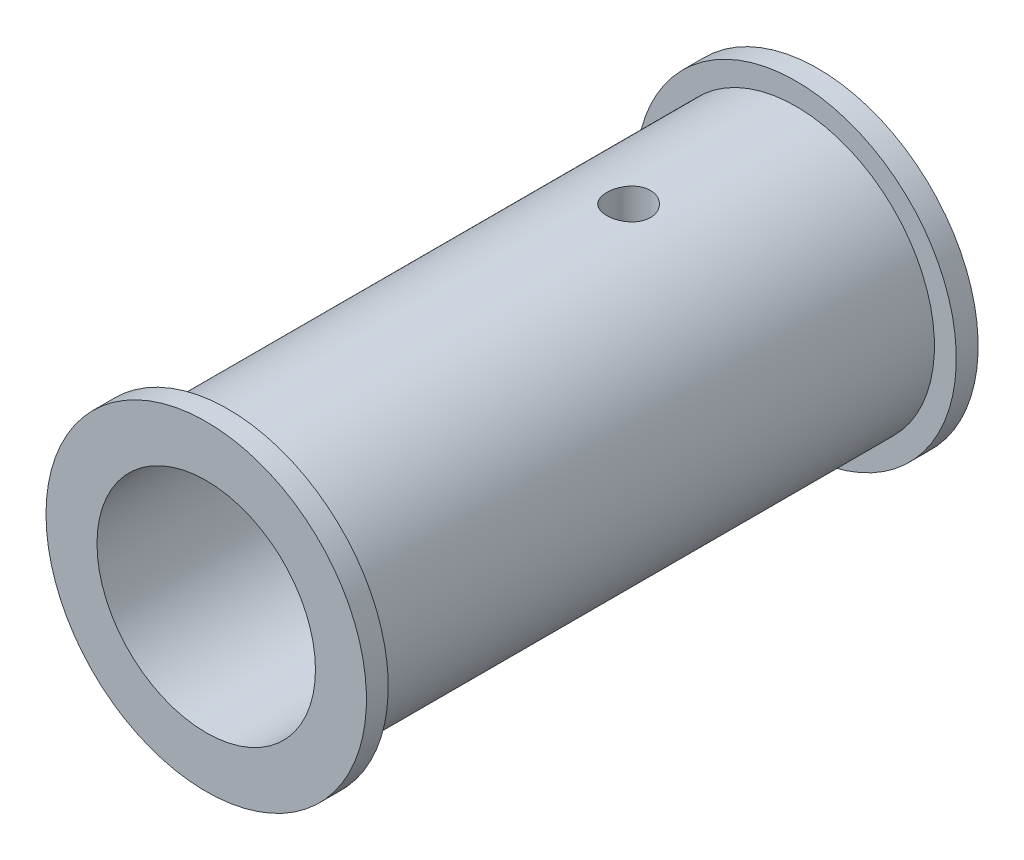
ISO-10303-21;
HEADER;
FILE_DESCRIPTION(('STEP AP214'),'2;1');
FILE_NAME('part.step','',(''),(''),'','','');
FILE_SCHEMA(('AUTOMOTIVE_DESIGN { 1 0 10303 214 1 1 1 1 }'));
ENDSEC;
DATA;
#1=APPLICATION_CONTEXT('core data for automotive mechanical design processes');
#2=APPLICATION_PROTOCOL_DEFINITION('international standard','automotive_design',2000,#1);
#3=PRODUCT_CONTEXT('',#1,'mechanical');
#4=PRODUCT('Part','Part','',(#3));
#5=PRODUCT_RELATED_PRODUCT_CATEGORY('part','',(#4));
#6=PRODUCT_DEFINITION_FORMATION('','',#4);
#7=PRODUCT_DEFINITION_CONTEXT('part definition',#1,'design');
#8=PRODUCT_DEFINITION('design','',#6,#7);
#9=PRODUCT_DEFINITION_SHAPE('','',#8);
#10=(LENGTH_UNIT() NAMED_UNIT(*) SI_UNIT(.MILLI.,.METRE.));
#11=(NAMED_UNIT(*) PLANE_ANGLE_UNIT() SI_UNIT($,.RADIAN.));
#12=(NAMED_UNIT(*) SI_UNIT($,.STERADIAN.) SOLID_ANGLE_UNIT());
#13=UNCERTAINTY_MEASURE_WITH_UNIT(LENGTH_MEASURE(1.E-05),#10,'distance_accuracy_value','');
#14=(GEOMETRIC_REPRESENTATION_CONTEXT(3) GLOBAL_UNCERTAINTY_ASSIGNED_CONTEXT((#13)) GLOBAL_UNIT_ASSIGNED_CONTEXT((#10,
#11,#12)) REPRESENTATION_CONTEXT('',''));
#15=CARTESIAN_POINT('',(0.,0.,0.));
#16=DIRECTION('',(0.,0.,1.));
#17=DIRECTION('',(1.,0.,0.));
#18=AXIS2_PLACEMENT_3D('',#15,#16,#17);
#19=CARTESIAN_POINT('',(0.,0.,0.));
#20=DIRECTION('',(0.,0.,-1.));
#21=DIRECTION('',(-1.,0.,0.));
#22=AXIS2_PLACEMENT_3D('',#19,#20,#21);
#23=CYLINDRICAL_SURFACE('',#22,9.49999999999999);
#24=CARTESIAN_POINT('',(0.,0.,-16.5));
#25=DIRECTION('',(0.,0.,-1.));
#26=DIRECTION('',(-1.,0.,0.));
#27=AXIS2_PLACEMENT_3D('',#24,#25,#26);
#28=CIRCLE('',#27,9.49999999999999);
#29=CARTESIAN_POINT('',(-9.49999999999999,0.,-16.5));
#30=VERTEX_POINT('',#29);
#31=EDGE_CURVE('E159',#30,#30,#28,.T.);
#32=ORIENTED_EDGE('',*,*,#31,.F.);
#33=EDGE_LOOP('',(#32));
#34=FACE_BOUND('',#33,.T.);
#35=CARTESIAN_POINT('',(0.,0.,22.5));
#36=DIRECTION('',(0.,0.,-1.));
#37=DIRECTION('',(-1.,0.,0.));
#38=AXIS2_PLACEMENT_3D('',#35,#36,#37);
#39=CIRCLE('',#38,9.49999999999999);
#40=CARTESIAN_POINT('',(-9.49999999999999,0.,22.5));
#41=VERTEX_POINT('',#40);
#42=EDGE_CURVE('E163',#41,#41,#39,.T.);
#43=ORIENTED_EDGE('',*,*,#42,.T.);
#44=EDGE_LOOP('',(#43));
#45=FACE_BOUND('',#44,.T.);
#46=CARTESIAN_POINT('',(0.,9.49999999999999,-6.5));
#47=CARTESIAN_POINT('',(0.0836976001065212,9.49999861203617,-6.49999659075089));
#48=CARTESIAN_POINT('',(0.167442437394015,9.4988823423191,-6.49297105489717));
#49=CARTESIAN_POINT('',(0.332587635211273,9.49453678011782,-6.46506375653031));
#50=CARTESIAN_POINT('',(0.413985694895261,9.49130548294468,-6.44416884792844));
#51=CARTESIAN_POINT('',(0.572023766729428,9.48309267200423,-6.38916582150304));
#52=CARTESIAN_POINT('',(0.648667457404599,9.47811253172854,-6.35506807066557));
#53=CARTESIAN_POINT('',(0.795134710469113,9.46695108120926,-6.27465345446147));
#54=CARTESIAN_POINT('',(0.864959141108909,9.46076992418341,-6.22833814746046));
#55=CARTESIAN_POINT('',(0.996418466512016,9.4478332438405,-6.12437811450022));
#56=CARTESIAN_POINT('',(1.05798606000114,9.44107365911175,-6.06664878123631));
#57=CARTESIAN_POINT('',(1.17060304704613,9.42777343334238,-5.94168151829407));
#58=CARTESIAN_POINT('',(1.22165180906462,9.4212328054674,-5.87444301810582));
#59=CARTESIAN_POINT('',(1.31204764005015,9.40907168619826,-5.73190915553054));
#60=CARTESIAN_POINT('',(1.35132892424659,9.40345644380091,-5.6565715852408));
#61=CARTESIAN_POINT('',(1.41665421811941,9.3938377586289,-5.50026432521204));
#62=CARTESIAN_POINT('',(1.44269902834657,9.38983421838047,-5.41929497642355));
#63=CARTESIAN_POINT('',(1.4806016253586,9.38393240557448,-5.25473305104834));
#64=CARTESIAN_POINT('',(1.49257509267669,9.382016976237,-5.17116774521641));
#65=CARTESIAN_POINT('',(1.50235362805524,9.38045626095233,-5.00319382694182));
#66=CARTESIAN_POINT('',(1.50015959652364,9.38081083073654,-4.91878526843207));
#67=CARTESIAN_POINT('',(1.48175980710843,9.38373437383501,-4.75234202844382));
#68=CARTESIAN_POINT('',(1.46568339888114,9.3862829041541,-4.67029263670841));
#69=CARTESIAN_POINT('',(1.4201779253579,9.39327524902391,-4.51007060392592));
#70=CARTESIAN_POINT('',(1.39074844516594,9.39771912246497,-4.43189808342161));
#71=CARTESIAN_POINT('',(1.3192392577636,9.40802379337807,-4.28125818725081));
#72=CARTESIAN_POINT('',(1.27710525865785,9.41389065039574,-4.20881701561895));
#73=CARTESIAN_POINT('',(1.1814216728908,9.42637594353947,-4.07198394790952));
#74=CARTESIAN_POINT('',(1.12787125747699,9.4329944342126,-4.00759263673453));
#75=CARTESIAN_POINT('',(1.01016734202821,9.44632735425787,-3.88793788340068));
#76=CARTESIAN_POINT('',(0.945902736525758,9.45304203303563,-3.83278370453035));
#77=CARTESIAN_POINT('',(0.808972007834443,9.46574266984971,-3.73402607857166));
#78=CARTESIAN_POINT('',(0.73630584030216,9.47172862403948,-3.69042269245236));
#79=CARTESIAN_POINT('',(0.584536306884603,9.48230461469924,-3.61599678624987));
#80=CARTESIAN_POINT('',(0.505428458120266,9.48689366833473,-3.58518325936849));
#81=CARTESIAN_POINT('',(0.343072096390924,9.49415073946818,-3.53730969299787));
#82=CARTESIAN_POINT('',(0.259823894418548,9.49681890101703,-3.52024862217756));
#83=CARTESIAN_POINT('',(0.0924923680310958,9.49991434597552,-3.5005108630843));
#84=CARTESIAN_POINT('',(0.00842716740136877,9.50036501369998,-3.49768406157555));
#85=CARTESIAN_POINT('',(-0.158976265712539,9.49903852875432,-3.50609582484365));
#86=CARTESIAN_POINT('',(-0.242314523112228,9.49726145274319,-3.51733390563322));
#87=CARTESIAN_POINT('',(-0.405439567370637,9.49169362069364,-3.55343158131569));
#88=CARTESIAN_POINT('',(-0.485243062795081,9.48791376028193,-3.57821749557923));
#89=CARTESIAN_POINT('',(-0.639561861197124,9.47876264558504,-3.64062916757298));
#90=CARTESIAN_POINT('',(-0.714076892756962,9.47339130969429,-3.67825558373644));
#91=CARTESIAN_POINT('',(-0.856359938682377,9.46159558199889,-3.7656284951105));
#92=CARTESIAN_POINT('',(-0.92406920731113,9.4551631094348,-3.81546954378735));
#93=CARTESIAN_POINT('',(-1.05021609132263,9.44198475905151,-3.92572600258905));
#94=CARTESIAN_POINT('',(-1.10865310573566,9.43523886095462,-3.98614209758918));
#95=CARTESIAN_POINT('',(-1.21514760920431,9.42211913600068,-4.11650426556288));
#96=CARTESIAN_POINT('',(-1.26310409838576,9.41574932753234,-4.18653331358802));
#97=CARTESIAN_POINT('',(-1.34657266649327,9.40417594303637,-4.33374131226607));
#98=CARTESIAN_POINT('',(-1.38208510941917,9.39897233289796,-4.41092005370034));
#99=CARTESIAN_POINT('',(-1.43950349612765,9.39035010587672,-4.56994411093857));
#100=CARTESIAN_POINT('',(-1.46146126125825,9.38692469878067,-4.65177033116239));
#101=CARTESIAN_POINT('',(-1.49131110199775,9.38222912838245,-4.81800766724035));
#102=CARTESIAN_POINT('',(-1.49920426388363,9.38095879863366,-4.90241858295376));
#103=CARTESIAN_POINT('',(-1.5006729373316,9.38072387634563,-5.07042167299111));
#104=CARTESIAN_POINT('',(-1.49440732883688,9.38173369742787,-5.15401246558048));
#105=CARTESIAN_POINT('',(-1.46807821019621,9.38588947240366,-5.31893513302053));
#106=CARTESIAN_POINT('',(-1.44801473210917,9.38903542133397,-5.40026701311925));
#107=CARTESIAN_POINT('',(-1.39471776903661,9.39709967714347,-5.55831106484561));
#108=CARTESIAN_POINT('',(-1.3614965806929,9.40201632881048,-5.63502747300764));
#109=CARTESIAN_POINT('',(-1.28284324745908,9.41306982252276,-5.7818235683254));
#110=CARTESIAN_POINT('',(-1.23741059974182,9.41920671481074,-5.8519029820311));
#111=CARTESIAN_POINT('',(-1.13505145080215,9.43209095828839,-5.98424096806291));
#112=CARTESIAN_POINT('',(-1.0780076272868,9.43884411780418,-6.04640824158857));
#113=CARTESIAN_POINT('',(-0.954293245344263,9.45215249855793,-6.16034348055255));
#114=CARTESIAN_POINT('',(-0.887620460616887,9.4587076735952,-6.21210903438498));
#115=CARTESIAN_POINT('',(-0.746056649485086,9.47092780190554,-6.3040585652105));
#116=CARTESIAN_POINT('',(-0.671117681090889,9.47658704267682,-6.34416948717269));
#117=CARTESIAN_POINT('',(-0.515509688205493,9.48632189921253,-6.41117359654583));
#118=CARTESIAN_POINT('',(-0.434846589899646,9.49039912533836,-6.43808023226726));
#119=CARTESIAN_POINT('',(-0.294869549677869,9.49559866677719,-6.4719290910522));
#120=CARTESIAN_POINT('',(-0.236411965071404,9.49724053176744,-6.48243924191617));
#121=CARTESIAN_POINT('',(-0.118644158414181,9.49944168248485,-6.49647585408426));
#122=CARTESIAN_POINT('',(-0.0593339487629794,9.50000098393948,-6.50000241684602));
#123=CARTESIAN_POINT('',(0.,9.49999999999999,-6.5));
#124=B_SPLINE_CURVE_WITH_KNOTS('',3,(#46,#47,#48,#49,#50,#51,#52,#53,#54,#55,#56,#57,#58,#59,
#60,#61,#62,#63,#64,#65,#66,#67,#68,#69,#70,#71,#72,#73,#74,#75,#76,#77,#78,#79,#80,#81,#82,#83,
#84,#85,#86,#87,#88,#89,#90,#91,#92,#93,#94,#95,#96,#97,#98,#99,#100,#101,#102,#103,#104,#105,
#106,#107,#108,#109,#110,#111,#112,#113,#114,#115,#116,#117,#118,#119,#120,#121,#122,#123),
.UNSPECIFIED.,.T.,.F.,(4,2,2,2,2,2,2,2,2,2,2,2,2,2,2,2,2,2,2,2,2,2,2,2,2,2,2,2,2,2,2,2,2,2,2,2,
2,2,4),(0.,0.250875955706268,0.501990044469083,0.752907354824666,1.00379267580462,
1.25661257446513,1.50944764769344,1.76367086508286,2.0178787050521,2.26998174901985,
2.52206877086913,2.77183199835411,3.02160298681438,3.27245685757923,3.52332894479686,
3.77698595667627,4.03064430741767,4.28448071735229,4.53829808968867,4.78943303847652,
5.0405593456862,5.2903332848928,5.54012003389346,5.79190509693548,6.04370647245532,
6.2978367744557,6.55195964228958,6.80510484781958,7.05823050087969,7.30852987505233,
7.55882866766462,7.80889409144677,8.05896981366678,8.31171040651354,8.56450952903007,
8.81886068521234,9.07295224922779,9.25080295634069,9.42865107961775),.UNSPECIFIED.);
#125=CARTESIAN_POINT('',(0.,9.49999999999999,-6.5));
#126=VERTEX_POINT('',#125);
#127=EDGE_CURVE('E268',#126,#126,#124,.T.);
#128=ORIENTED_EDGE('',*,*,#127,.T.);
#129=EDGE_LOOP('',(#128));
#130=FACE_BOUND('',#129,.T.);
#131=ADVANCED_FACE('F39',(#34,#45,#130),#23,.T.);
#132=CARTESIAN_POINT('',(0.,0.,24.));
#133=DIRECTION('',(0.,0.,-1.));
#134=DIRECTION('',(-1.,0.,0.));
#135=AXIS2_PLACEMENT_3D('',#132,#133,#134);
#136=CYLINDRICAL_SURFACE('',#135,1.625);
#137=CARTESIAN_POINT('',(-1.17260393995586,1.125,-4.06458565330652));
#138=CARTESIAN_POINT('',(-1.20022714013126,1.09622432298057,-4.09924565467638));
#139=CARTESIAN_POINT('',(-1.22617661587613,1.06703951441178,-4.13489321189148));
#140=CARTESIAN_POINT('',(-1.27483011000231,1.00840388851461,-4.2083130634996));
#141=CARTESIAN_POINT('',(-1.29752605637577,0.978952595930875,-4.24609032920958));
#142=CARTESIAN_POINT('',(-1.34003380650496,0.919936148018511,-4.32447672055218));
#143=CARTESIAN_POINT('',(-1.35978375137415,0.890379159335731,-4.36512558740368));
#144=CARTESIAN_POINT('',(-1.39582543492463,0.832733729430751,-4.44886513462266));
#145=CARTESIAN_POINT('',(-1.41212176382786,0.804643376818595,-4.49195247619628));
#146=CARTESIAN_POINT('',(-1.43838519898778,0.75649131726744,-4.57280018446079));
#147=CARTESIAN_POINT('',(-1.44896606199368,0.735911175635253,-4.61004723352425));
#148=CARTESIAN_POINT('',(-1.46747703971674,0.698264422935175,-4.68684562389044));
#149=CARTESIAN_POINT('',(-1.47541459445183,0.681188003058495,-4.7263901232697));
#150=CARTESIAN_POINT('',(-1.487140666969,0.655139884352709,-4.80104515868793));
#151=CARTESIAN_POINT('',(-1.49140632512198,0.645281993448703,-4.83575911858646));
#152=CARTESIAN_POINT('',(-1.49749705581273,0.631023830593352,-4.90644905253058));
#153=CARTESIAN_POINT('',(-1.4993300436096,0.626605861994436,-4.94242054084139));
#154=CARTESIAN_POINT('',(-1.50036545087351,0.624124706493151,-5.01483651677507));
#155=CARTESIAN_POINT('',(-1.49955325195683,0.626096833566492,-5.05128252047585));
#156=CARTESIAN_POINT('',(-1.49536628790401,0.636027143095433,-5.123236785813));
#157=CARTESIAN_POINT('',(-1.49198461279409,0.644001466436737,-5.1587422512));
#158=CARTESIAN_POINT('',(-1.48086954179096,0.66926165193282,-5.24425779307089));
#159=CARTESIAN_POINT('',(-1.47184117227263,0.689157243619557,-5.29329463203288));
#160=CARTESIAN_POINT('',(-1.44976365180078,0.734473786190448,-5.38804636197724));
#161=CARTESIAN_POINT('',(-1.43668319621101,0.759937285363707,-5.43373183935813));
#162=CARTESIAN_POINT('',(-1.40725379807304,0.813124245642371,-5.52126737710328));
#163=CARTESIAN_POINT('',(-1.39097586816154,0.840791966818111,-5.56317608850523));
#164=CARTESIAN_POINT('',(-1.35512503015131,0.897434100832623,-5.64468559909831));
#165=CARTESIAN_POINT('',(-1.33554863617344,0.92640987207578,-5.68428389636536));
#166=CARTESIAN_POINT('',(-1.29378321751754,0.983855871192155,-5.76022836882435));
#167=CARTESIAN_POINT('',(-1.27169150292504,1.01231475718663,-5.79663676757484));
#168=CARTESIAN_POINT('',(-1.22445230285109,1.06897476509183,-5.86747445508932));
#169=CARTESIAN_POINT('',(-1.19931097229051,1.09717628662975,-5.90190753019538));
#170=CARTESIAN_POINT('',(-1.17260393995588,1.12500000000004,-5.93541434669347));
#171=B_SPLINE_CURVE_WITH_KNOTS('',3,(#137,#138,#139,#140,#141,#142,#143,#144,#145,#146,#147,
#148,#149,#150,#151,#152,#153,#154,#155,#156,#157,#158,#159,#160,#161,#162,#163,#164,#165,#166,
#167,#168,#169,#170),.UNSPECIFIED.,.F.,.F.,(4,2,2,2,2,2,2,2,2,2,2,2,2,2,2,2,4),(0.,
0.158487043094385,0.317360728731127,0.479204878766889,0.640832552653263,0.772194830544568,
0.903184179830365,1.01179651227962,1.12005457569085,1.22891193047488,1.3380630710086,
1.49820849347329,1.65962335650607,1.81779244444308,1.97612974912018,2.12966216285675,
2.28288970879936),.UNSPECIFIED.);
#172=CARTESIAN_POINT('',(-1.17260393995586,1.125,-4.06458565330651));
#173=VERTEX_POINT('',#172);
#174=CARTESIAN_POINT('',(-1.17260393995586,1.125,-5.93541434669349));
#175=VERTEX_POINT('',#174);
#176=EDGE_CURVE('E106',#173,#175,#171,.T.);
#177=ORIENTED_EDGE('',*,*,#176,.F.);
#178=DIRECTION('',(0.,0.,-1.));
#179=VECTOR('',#178,1.);
#180=CARTESIAN_POINT('',(-1.17260393995586,1.125,24.));
#181=LINE('',#180,#179);
#182=CARTESIAN_POINT('',(-1.17260393995586,1.125,0.));
#183=VERTEX_POINT('',#182);
#184=EDGE_CURVE('E120',#183,#173,#181,.T.);
#185=ORIENTED_EDGE('',*,*,#184,.F.);
#186=CARTESIAN_POINT('',(0.,0.,0.));
#187=DIRECTION('',(0.,0.,1.));
#188=DIRECTION('',(1.,0.,0.));
#189=AXIS2_PLACEMENT_3D('',#186,#187,#188);
#190=CIRCLE('',#189,1.625);
#191=CARTESIAN_POINT('',(1.17260393995586,1.125,0.));
#192=VERTEX_POINT('',#191);
#193=EDGE_CURVE('E181',#183,#192,#190,.T.);
#194=ORIENTED_EDGE('',*,*,#193,.T.);
#195=DIRECTION('',(0.,0.,-1.));
#196=VECTOR('',#195,1.);
#197=CARTESIAN_POINT('',(1.17260393995586,1.125,24.));
#198=LINE('',#197,#196);
#199=CARTESIAN_POINT('',(1.17260393995586,1.125,-4.06458565330651));
#200=VERTEX_POINT('',#199);
#201=EDGE_CURVE('E134',#192,#200,#198,.T.);
#202=ORIENTED_EDGE('',*,*,#201,.T.);
#203=CARTESIAN_POINT('',(1.17260393995586,1.125,-5.93541434669349));
#204=CARTESIAN_POINT('',(1.20022714013126,1.09622432298057,-5.90075434532362));
#205=CARTESIAN_POINT('',(1.22617661587613,1.06703951441178,-5.86510678810852));
#206=CARTESIAN_POINT('',(1.27483011000231,1.00840388851461,-5.7916869365004));
#207=CARTESIAN_POINT('',(1.29752605637577,0.978952595930875,-5.75390967079042));
#208=CARTESIAN_POINT('',(1.34003380650496,0.919936148018512,-5.67552327944782));
#209=CARTESIAN_POINT('',(1.35978375137415,0.890379159335732,-5.63487441259632));
#210=CARTESIAN_POINT('',(1.39582543492463,0.832733729430751,-5.55113486537734));
#211=CARTESIAN_POINT('',(1.41212176382786,0.804643376818596,-5.50804752380372));
#212=CARTESIAN_POINT('',(1.43838519898778,0.75649131726744,-5.42719981553921));
#213=CARTESIAN_POINT('',(1.44896606199368,0.735911175635253,-5.38995276647575));
#214=CARTESIAN_POINT('',(1.46747703971674,0.698264422935176,-5.31315437610956));
#215=CARTESIAN_POINT('',(1.47541459445183,0.681188003058496,-5.2736098767303));
#216=CARTESIAN_POINT('',(1.487140666969,0.65513988435271,-5.19895484131207));
#217=CARTESIAN_POINT('',(1.49140632512198,0.645281993448702,-5.16424088141354));
#218=CARTESIAN_POINT('',(1.49749705581273,0.631023830593352,-5.09355094746942));
#219=CARTESIAN_POINT('',(1.4993300436096,0.626605861994436,-5.05757945915861));
#220=CARTESIAN_POINT('',(1.50036545087351,0.624124706493151,-4.98516348322493));
#221=CARTESIAN_POINT('',(1.49955325195683,0.626096833566492,-4.94871747952415));
#222=CARTESIAN_POINT('',(1.49536628790401,0.636027143095433,-4.876763214187));
#223=CARTESIAN_POINT('',(1.49198461279409,0.644001466436738,-4.8412577488));
#224=CARTESIAN_POINT('',(1.48086954179096,0.66926165193282,-4.75574220692911));
#225=CARTESIAN_POINT('',(1.47184117227263,0.689157243619557,-4.70670536796712));
#226=CARTESIAN_POINT('',(1.44976365180078,0.734473786190447,-4.61195363802276));
#227=CARTESIAN_POINT('',(1.43668319621101,0.759937285363707,-4.56626816064187));
#228=CARTESIAN_POINT('',(1.40725379807304,0.81312424564237,-4.47873262289672));
#229=CARTESIAN_POINT('',(1.39097586816154,0.84079196681811,-4.43682391149477));
#230=CARTESIAN_POINT('',(1.35512503015131,0.897434100832622,-4.35531440090169));
#231=CARTESIAN_POINT('',(1.33554863617344,0.92640987207578,-4.31571610363464));
#232=CARTESIAN_POINT('',(1.29378321751754,0.983855871192155,-4.23977163117565));
#233=CARTESIAN_POINT('',(1.27169150292504,1.01231475718663,-4.20336323242516));
#234=CARTESIAN_POINT('',(1.22445230285109,1.06897476509183,-4.13252554491068));
#235=CARTESIAN_POINT('',(1.19931097229051,1.09717628662975,-4.09809246980462));
#236=CARTESIAN_POINT('',(1.17260393995588,1.12500000000004,-4.06458565330653));
#237=B_SPLINE_CURVE_WITH_KNOTS('',3,(#203,#204,#205,#206,#207,#208,#209,#210,#211,#212,#213,
#214,#215,#216,#217,#218,#219,#220,#221,#222,#223,#224,#225,#226,#227,#228,#229,#230,#231,#232,
#233,#234,#235,#236),.UNSPECIFIED.,.F.,.F.,(4,2,2,2,2,2,2,2,2,2,2,2,2,2,2,2,4),(0.,
0.158487043094385,0.317360728731128,0.479204878766888,0.640832552653262,0.772194830544568,
0.903184179830366,1.01179651227962,1.12005457569085,1.22891193047488,1.3380630710086,
1.49820849347329,1.65962335650607,1.81779244444308,1.97612974912018,2.12966216285675,
2.28288970879936),.UNSPECIFIED.);
#238=CARTESIAN_POINT('',(1.17260393995586,1.125,-5.93541434669349));
#239=VERTEX_POINT('',#238);
#240=EDGE_CURVE('E56',#239,#200,#237,.T.);
#241=ORIENTED_EDGE('',*,*,#240,.F.);
#242=CARTESIAN_POINT('',(1.17260393995586,1.125,-10.));
#243=VERTEX_POINT('',#242);
#244=EDGE_CURVE('E130',#239,#243,#198,.T.);
#245=ORIENTED_EDGE('',*,*,#244,.T.);
#246=CARTESIAN_POINT('',(0.,0.,-10.));
#247=DIRECTION('',(0.,0.,-1.));
#248=DIRECTION('',(-1.,0.,0.));
#249=AXIS2_PLACEMENT_3D('',#246,#247,#248);
#250=CIRCLE('',#249,1.625);
#251=CARTESIAN_POINT('',(-1.17260393995586,1.125,-10.));
#252=VERTEX_POINT('',#251);
#253=EDGE_CURVE('E231',#243,#252,#250,.T.);
#254=ORIENTED_EDGE('',*,*,#253,.T.);
#255=EDGE_CURVE('E123',#175,#252,#181,.T.);
#256=ORIENTED_EDGE('',*,*,#255,.F.);
#257=EDGE_LOOP('',(#177,#185,#194,#202,#241,#245,#254,#256));
#258=FACE_BOUND('',#257,.T.);
#259=ADVANCED_FACE('F118',(#258),#136,.F.);
#260=CARTESIAN_POINT('',(1.17260393995586,1.125,24.));
#261=DIRECTION('',(0.,1.,0.));
#262=DIRECTION('',(0.,0.,1.));
#263=AXIS2_PLACEMENT_3D('',#260,#261,#262);
#264=PLANE('',#263);
#265=CARTESIAN_POINT('',(0.,1.125,-5.));
#266=DIRECTION('',(0.,1.,0.));
#267=DIRECTION('',(0.,0.,1.));
#268=AXIS2_PLACEMENT_3D('',#265,#266,#267);
#269=CIRCLE('',#268,1.5);
#270=EDGE_CURVE('E114',#175,#239,#269,.F.);
#271=ORIENTED_EDGE('',*,*,#270,.F.);
#272=ORIENTED_EDGE('',*,*,#255,.T.);
#273=DIRECTION('',(1.,0.,0.));
#274=VECTOR('',#273,1.);
#275=CARTESIAN_POINT('',(1.17260393995586,1.125,-10.));
#276=LINE('',#275,#274);
#277=EDGE_CURVE('E136',#252,#243,#276,.T.);
#278=ORIENTED_EDGE('',*,*,#277,.T.);
#279=ORIENTED_EDGE('',*,*,#244,.F.);
#280=EDGE_LOOP('',(#271,#272,#278,#279));
#281=FACE_BOUND('',#280,.T.);
#282=ADVANCED_FACE('F239',(#281),#264,.F.);
#283=EDGE_CURVE('E103',#200,#173,#269,.F.);
#284=ORIENTED_EDGE('',*,*,#283,.F.);
#285=ORIENTED_EDGE('',*,*,#201,.F.);
#286=DIRECTION('',(-1.,0.,0.));
#287=VECTOR('',#286,1.);
#288=CARTESIAN_POINT('',(0.,1.125,0.));
#289=LINE('',#288,#287);
#290=EDGE_CURVE('E128',#192,#183,#289,.T.);
#291=ORIENTED_EDGE('',*,*,#290,.T.);
#292=ORIENTED_EDGE('',*,*,#184,.T.);
#293=EDGE_LOOP('',(#284,#285,#291,#292));
#294=FACE_BOUND('',#293,.T.);
#295=ADVANCED_FACE('F126',(#294),#264,.F.);
#296=CARTESIAN_POINT('',(2.8,2.125,24.));
#297=DIRECTION('',(0.,-1.,0.));
#298=DIRECTION('',(0.,0.,-1.));
#299=AXIS2_PLACEMENT_3D('',#296,#297,#298);
#300=PLANE('',#299);
#301=DIRECTION('',(1.,0.,0.));
#302=VECTOR('',#301,1.);
#303=CARTESIAN_POINT('',(0.,2.125,0.));
#304=LINE('',#303,#302);
#305=CARTESIAN_POINT('',(-2.8,2.125,0.));
#306=VERTEX_POINT('',#305);
#307=CARTESIAN_POINT('',(2.8,2.125,0.));
#308=VERTEX_POINT('',#307);
#309=EDGE_CURVE('E49',#306,#308,#304,.T.);
#310=ORIENTED_EDGE('',*,*,#309,.T.);
#311=DIRECTION('',(0.,0.,-1.));
#312=VECTOR('',#311,1.);
#313=CARTESIAN_POINT('',(2.8,2.125,24.));
#314=LINE('',#313,#312);
#315=CARTESIAN_POINT('',(2.8,2.125,-10.));
#316=VERTEX_POINT('',#315);
#317=EDGE_CURVE('E199',#308,#316,#314,.T.);
#318=ORIENTED_EDGE('',*,*,#317,.T.);
#319=DIRECTION('',(-1.,0.,0.));
#320=VECTOR('',#319,1.);
#321=CARTESIAN_POINT('',(2.8,2.125,-10.));
#322=LINE('',#321,#320);
#323=CARTESIAN_POINT('',(-2.8,2.125,-10.));
#324=VERTEX_POINT('',#323);
#325=EDGE_CURVE('E224',#316,#324,#322,.T.);
#326=ORIENTED_EDGE('',*,*,#325,.T.);
#327=DIRECTION('',(0.,0.,-1.));
#328=VECTOR('',#327,1.);
#329=CARTESIAN_POINT('',(-2.8,2.125,24.));
#330=LINE('',#329,#328);
#331=EDGE_CURVE('E201',#306,#324,#330,.T.);
#332=ORIENTED_EDGE('',*,*,#331,.F.);
#333=EDGE_LOOP('',(#310,#318,#326,#332));
#334=FACE_BOUND('',#333,.T.);
#335=CARTESIAN_POINT('',(0.,2.125,-5.));
#336=DIRECTION('',(0.,-1.,0.));
#337=DIRECTION('',(0.,0.,-1.));
#338=AXIS2_PLACEMENT_3D('',#335,#336,#337);
#339=CIRCLE('',#338,1.5);
#340=CARTESIAN_POINT('',(0.,2.125,-6.5));
#341=VERTEX_POINT('',#340);
#342=EDGE_CURVE('E112',#341,#341,#339,.F.);
#343=ORIENTED_EDGE('',*,*,#342,.F.);
#344=EDGE_LOOP('',(#343));
#345=FACE_BOUND('',#344,.T.);
#346=ADVANCED_FACE('F196',(#334,#345),#300,.F.);
#347=CARTESIAN_POINT('',(2.8,4.625,24.));
#348=DIRECTION('',(0.,1.,0.));
#349=DIRECTION('',(-1.,0.,0.));
#350=AXIS2_PLACEMENT_3D('',#347,#348,#349);
#351=PLANE('',#350);
#352=DIRECTION('',(-1.,0.,0.));
#353=VECTOR('',#352,1.);
#354=CARTESIAN_POINT('',(0.,4.625,0.));
#355=LINE('',#354,#353);
#356=CARTESIAN_POINT('',(2.8,4.625,0.));
#357=VERTEX_POINT('',#356);
#358=CARTESIAN_POINT('',(-2.8,4.625,0.));
#359=VERTEX_POINT('',#358);
#360=EDGE_CURVE('E184',#357,#359,#355,.T.);
#361=ORIENTED_EDGE('',*,*,#360,.T.);
#362=DIRECTION('',(0.,0.,-1.));
#363=VECTOR('',#362,1.);
#364=CARTESIAN_POINT('',(-2.8,4.625,24.));
#365=LINE('',#364,#363);
#366=CARTESIAN_POINT('',(-2.8,4.625,-10.));
#367=VERTEX_POINT('',#366);
#368=EDGE_CURVE('E220',#359,#367,#365,.T.);
#369=ORIENTED_EDGE('',*,*,#368,.T.);
#370=DIRECTION('',(1.,0.,0.));
#371=VECTOR('',#370,1.);
#372=CARTESIAN_POINT('',(2.8,4.625,-10.));
#373=LINE('',#372,#371);
#374=CARTESIAN_POINT('',(2.8,4.625,-10.));
#375=VERTEX_POINT('',#374);
#376=EDGE_CURVE('E467',#367,#375,#373,.T.);
#377=ORIENTED_EDGE('',*,*,#376,.T.);
#378=DIRECTION('',(0.,0.,-1.));
#379=VECTOR('',#378,1.);
#380=CARTESIAN_POINT('',(2.8,4.625,24.));
#381=LINE('',#380,#379);
#382=EDGE_CURVE('E212',#357,#375,#381,.T.);
#383=ORIENTED_EDGE('',*,*,#382,.F.);
#384=EDGE_LOOP('',(#361,#369,#377,#383));
#385=FACE_BOUND('',#384,.T.);
#386=CARTESIAN_POINT('',(0.,4.625,-5.));
#387=DIRECTION('',(0.,1.,0.));
#388=DIRECTION('',(-1.,0.,0.));
#389=AXIS2_PLACEMENT_3D('',#386,#387,#388);
#390=CIRCLE('',#389,1.5);
#391=CARTESIAN_POINT('',(-1.5,4.625,-5.));
#392=VERTEX_POINT('',#391);
#393=EDGE_CURVE('E43',#392,#392,#390,.F.);
#394=ORIENTED_EDGE('',*,*,#393,.F.);
#395=EDGE_LOOP('',(#394));
#396=FACE_BOUND('',#395,.T.);
#397=ADVANCED_FACE('F217',(#385,#396),#351,.F.);
#398=CARTESIAN_POINT('',(0.,0.,0.));
#399=DIRECTION('',(0.,0.,-1.));
#400=DIRECTION('',(-1.,0.,0.));
#401=AXIS2_PLACEMENT_3D('',#398,#399,#400);
#402=CYLINDRICAL_SURFACE('',#401,7.49999999999999);
#403=CARTESIAN_POINT('',(0.,0.,0.));
#404=DIRECTION('',(0.,0.,-1.));
#405=DIRECTION('',(-1.,0.,0.));
#406=AXIS2_PLACEMENT_3D('',#403,#404,#405);
#407=CIRCLE('',#406,7.49999999999999);
#408=CARTESIAN_POINT('',(-7.49999999999999,0.,0.));
#409=VERTEX_POINT('',#408);
#410=EDGE_CURVE('E139',#409,#409,#407,.T.);
#411=ORIENTED_EDGE('',*,*,#410,.T.);
#412=EDGE_LOOP('',(#411));
#413=FACE_BOUND('',#412,.T.);
#414=CARTESIAN_POINT('',(0.,0.,24.));
#415=DIRECTION('',(0.,0.,-1.));
#416=DIRECTION('',(-1.,0.,0.));
#417=AXIS2_PLACEMENT_3D('',#414,#415,#416);
#418=CIRCLE('',#417,7.49999999999999);
#419=CARTESIAN_POINT('',(-7.49999999999999,0.,24.));
#420=VERTEX_POINT('',#419);
#421=EDGE_CURVE('E175',#420,#420,#418,.T.);
#422=ORIENTED_EDGE('',*,*,#421,.F.);
#423=EDGE_LOOP('',(#422));
#424=FACE_BOUND('',#423,.T.);
#425=ADVANCED_FACE('F41',(#413,#424),#402,.F.);
#426=CARTESIAN_POINT('',(0.,7.49999999999999,24.));
#427=DIRECTION('',(0.,0.,1.));
#428=DIRECTION('',(1.,0.,0.));
#429=AXIS2_PLACEMENT_3D('',#426,#427,#428);
#430=PLANE('',#429);
#431=ORIENTED_EDGE('',*,*,#421,.T.);
#432=EDGE_LOOP('',(#431));
#433=FACE_BOUND('',#432,.T.);
#434=CARTESIAN_POINT('',(0.,0.,24.));
#435=DIRECTION('',(0.,0.,-1.));
#436=DIRECTION('',(-1.,0.,0.));
#437=AXIS2_PLACEMENT_3D('',#434,#435,#436);
#438=CIRCLE('',#437,11.);
#439=CARTESIAN_POINT('',(-11.,0.,24.));
#440=VERTEX_POINT('',#439);
#441=EDGE_CURVE('E171',#440,#440,#438,.T.);
#442=ORIENTED_EDGE('',*,*,#441,.F.);
#443=EDGE_LOOP('',(#442));
#444=FACE_BOUND('',#443,.T.);
#445=ADVANCED_FACE('F290',(#433,#444),#430,.T.);
#446=CARTESIAN_POINT('',(0.,0.,0.));
#447=DIRECTION('',(0.,0.,-1.));
#448=DIRECTION('',(-1.,0.,0.));
#449=AXIS2_PLACEMENT_3D('',#446,#447,#448);
#450=CYLINDRICAL_SURFACE('',#449,11.);
#451=ORIENTED_EDGE('',*,*,#441,.T.);
#452=EDGE_LOOP('',(#451));
#453=FACE_BOUND('',#452,.T.);
#454=CARTESIAN_POINT('',(0.,0.,22.5));
#455=DIRECTION('',(0.,0.,-1.));
#456=DIRECTION('',(-1.,0.,0.));
#457=AXIS2_PLACEMENT_3D('',#454,#455,#456);
#458=CIRCLE('',#457,11.);
#459=CARTESIAN_POINT('',(-11.,0.,22.5));
#460=VERTEX_POINT('',#459);
#461=EDGE_CURVE('E167',#460,#460,#458,.T.);
#462=ORIENTED_EDGE('',*,*,#461,.F.);
#463=EDGE_LOOP('',(#462));
#464=FACE_BOUND('',#463,.T.);
#465=ADVANCED_FACE('F287',(#453,#464),#450,.T.);
#466=CARTESIAN_POINT('',(0.,11.,22.5));
#467=DIRECTION('',(0.,0.,-1.));
#468=DIRECTION('',(-1.,0.,0.));
#469=AXIS2_PLACEMENT_3D('',#466,#467,#468);
#470=PLANE('',#469);
#471=ORIENTED_EDGE('',*,*,#461,.T.);
#472=EDGE_LOOP('',(#471));
#473=FACE_BOUND('',#472,.T.);
#474=ORIENTED_EDGE('',*,*,#42,.F.);
#475=EDGE_LOOP('',(#474));
#476=FACE_BOUND('',#475,.T.);
#477=ADVANCED_FACE('F284',(#473,#476),#470,.T.);
#478=CARTESIAN_POINT('',(0.,9.49999999999999,-16.5));
#479=DIRECTION('',(0.,0.,1.));
#480=DIRECTION('',(1.,0.,0.));
#481=AXIS2_PLACEMENT_3D('',#478,#479,#480);
#482=PLANE('',#481);
#483=ORIENTED_EDGE('',*,*,#31,.T.);
#484=EDGE_LOOP('',(#483));
#485=FACE_BOUND('',#484,.T.);
#486=CARTESIAN_POINT('',(0.,0.,-16.5));
#487=DIRECTION('',(0.,0.,-1.));
#488=DIRECTION('',(-1.,0.,0.));
#489=AXIS2_PLACEMENT_3D('',#486,#487,#488);
#490=CIRCLE('',#489,11.);
#491=CARTESIAN_POINT('',(-11.,0.,-16.5));
#492=VERTEX_POINT('',#491);
#493=EDGE_CURVE('E155',#492,#492,#490,.T.);
#494=ORIENTED_EDGE('',*,*,#493,.F.);
#495=EDGE_LOOP('',(#494));
#496=FACE_BOUND('',#495,.T.);
#497=ADVANCED_FACE('F282',(#485,#496),#482,.T.);
#498=CARTESIAN_POINT('',(0.,0.,0.));
#499=DIRECTION('',(0.,0.,-1.));
#500=DIRECTION('',(-1.,0.,0.));
#501=AXIS2_PLACEMENT_3D('',#498,#499,#500);
#502=CYLINDRICAL_SURFACE('',#501,11.);
#503=ORIENTED_EDGE('',*,*,#493,.T.);
#504=EDGE_LOOP('',(#503));
#505=FACE_BOUND('',#504,.T.);
#506=CARTESIAN_POINT('',(0.,0.,-18.));
#507=DIRECTION('',(0.,0.,-1.));
#508=DIRECTION('',(-1.,0.,0.));
#509=AXIS2_PLACEMENT_3D('',#506,#507,#508);
#510=CIRCLE('',#509,11.);
#511=CARTESIAN_POINT('',(-11.,0.,-18.));
#512=VERTEX_POINT('',#511);
#513=EDGE_CURVE('E151',#512,#512,#510,.T.);
#514=ORIENTED_EDGE('',*,*,#513,.F.);
#515=EDGE_LOOP('',(#514));
#516=FACE_BOUND('',#515,.T.);
#517=ADVANCED_FACE('F412',(#505,#516),#502,.T.);
#518=CARTESIAN_POINT('',(0.,11.,-18.));
#519=DIRECTION('',(0.,0.,-1.));
#520=DIRECTION('',(-1.,0.,0.));
#521=AXIS2_PLACEMENT_3D('',#518,#519,#520);
#522=PLANE('',#521);
#523=ORIENTED_EDGE('',*,*,#513,.T.);
#524=EDGE_LOOP('',(#523));
#525=FACE_BOUND('',#524,.T.);
#526=CARTESIAN_POINT('',(0.,0.,-18.));
#527=DIRECTION('',(0.,0.,-1.));
#528=DIRECTION('',(-1.,0.,0.));
#529=AXIS2_PLACEMENT_3D('',#526,#527,#528);
#530=CIRCLE('',#529,8.00000000000001);
#531=CARTESIAN_POINT('',(-8.00000000000001,0.,-18.));
#532=VERTEX_POINT('',#531);
#533=EDGE_CURVE('E147',#532,#532,#530,.T.);
#534=ORIENTED_EDGE('',*,*,#533,.F.);
#535=EDGE_LOOP('',(#534));
#536=FACE_BOUND('',#535,.T.);
#537=ADVANCED_FACE('F403',(#525,#536),#522,.T.);
#538=CARTESIAN_POINT('',(0.,0.,0.));
#539=DIRECTION('',(0.,0.,-1.));
#540=DIRECTION('',(-1.,0.,0.));
#541=AXIS2_PLACEMENT_3D('',#538,#539,#540);
#542=CYLINDRICAL_SURFACE('',#541,8.);
#543=ORIENTED_EDGE('',*,*,#533,.T.);
#544=EDGE_LOOP('',(#543));
#545=FACE_BOUND('',#544,.T.);
#546=CARTESIAN_POINT('',(0.,0.,-10.));
#547=DIRECTION('',(0.,0.,-1.));
#548=DIRECTION('',(-1.,0.,0.));
#549=AXIS2_PLACEMENT_3D('',#546,#547,#548);
#550=CIRCLE('',#549,8.);
#551=CARTESIAN_POINT('',(-8.,0.,-10.));
#552=VERTEX_POINT('',#551);
#553=EDGE_CURVE('E143',#552,#552,#550,.T.);
#554=ORIENTED_EDGE('',*,*,#553,.F.);
#555=EDGE_LOOP('',(#554));
#556=FACE_BOUND('',#555,.T.);
#557=ADVANCED_FACE('F394',(#545,#556),#542,.F.);
#558=CARTESIAN_POINT('',(0.,8.,-10.));
#559=DIRECTION('',(0.,0.,-1.));
#560=DIRECTION('',(-1.,0.,0.));
#561=AXIS2_PLACEMENT_3D('',#558,#559,#560);
#562=PLANE('',#561);
#563=DIRECTION('',(0.,1.,0.));
#564=VECTOR('',#563,1.);
#565=CARTESIAN_POINT('',(-2.8,4.625,-10.));
#566=LINE('',#565,#564);
#567=EDGE_CURVE('E64',#324,#367,#566,.T.);
#568=ORIENTED_EDGE('',*,*,#567,.F.);
#569=ORIENTED_EDGE('',*,*,#325,.F.);
#570=DIRECTION('',(0.,-1.,0.));
#571=VECTOR('',#570,1.);
#572=CARTESIAN_POINT('',(2.8,4.625,-10.));
#573=LINE('',#572,#571);
#574=EDGE_CURVE('E209',#375,#316,#573,.T.);
#575=ORIENTED_EDGE('',*,*,#574,.F.);
#576=ORIENTED_EDGE('',*,*,#376,.F.);
#577=EDGE_LOOP('',(#568,#569,#575,#576));
#578=FACE_BOUND('',#577,.T.);
#579=ORIENTED_EDGE('',*,*,#253,.F.);
#580=ORIENTED_EDGE('',*,*,#277,.F.);
#581=EDGE_LOOP('',(#579,#580));
#582=FACE_BOUND('',#581,.T.);
#583=ORIENTED_EDGE('',*,*,#553,.T.);
#584=EDGE_LOOP('',(#583));
#585=FACE_BOUND('',#584,.T.);
#586=ADVANCED_FACE('F241',(#578,#582,#585),#562,.T.);
#587=CARTESIAN_POINT('',(0.,7.49999999999999,0.));
#588=DIRECTION('',(0.,0.,1.));
#589=DIRECTION('',(1.,0.,0.));
#590=AXIS2_PLACEMENT_3D('',#587,#588,#589);
#591=PLANE('',#590);
#592=DIRECTION('',(0.,-1.,0.));
#593=VECTOR('',#592,1.);
#594=CARTESIAN_POINT('',(-2.8,7.49999999999999,0.));
#595=LINE('',#594,#593);
#596=EDGE_CURVE('E11',#359,#306,#595,.T.);
#597=ORIENTED_EDGE('',*,*,#596,.F.);
#598=ORIENTED_EDGE('',*,*,#360,.F.);
#599=DIRECTION('',(0.,1.,0.));
#600=VECTOR('',#599,1.);
#601=CARTESIAN_POINT('',(2.8,7.49999999999999,0.));
#602=LINE('',#601,#600);
#603=EDGE_CURVE('E187',#308,#357,#602,.T.);
#604=ORIENTED_EDGE('',*,*,#603,.F.);
#605=ORIENTED_EDGE('',*,*,#309,.F.);
#606=EDGE_LOOP('',(#597,#598,#604,#605));
#607=FACE_BOUND('',#606,.T.);
#608=ORIENTED_EDGE('',*,*,#193,.F.);
#609=ORIENTED_EDGE('',*,*,#290,.F.);
#610=EDGE_LOOP('',(#608,#609));
#611=FACE_BOUND('',#610,.T.);
#612=ORIENTED_EDGE('',*,*,#410,.F.);
#613=EDGE_LOOP('',(#612));
#614=FACE_BOUND('',#613,.T.);
#615=ADVANCED_FACE('F214',(#607,#611,#614),#591,.T.);
#616=CARTESIAN_POINT('',(-2.8,4.625,24.));
#617=DIRECTION('',(-1.,0.,0.));
#618=DIRECTION('',(0.,-1.,0.));
#619=AXIS2_PLACEMENT_3D('',#616,#617,#618);
#620=PLANE('',#619);
#621=ORIENTED_EDGE('',*,*,#596,.T.);
#622=ORIENTED_EDGE('',*,*,#331,.T.);
#623=ORIENTED_EDGE('',*,*,#567,.T.);
#624=ORIENTED_EDGE('',*,*,#368,.F.);
#625=EDGE_LOOP('',(#621,#622,#623,#624));
#626=FACE_BOUND('',#625,.T.);
#627=ADVANCED_FACE('F222',(#626),#620,.F.);
#628=CARTESIAN_POINT('',(2.8,4.625,24.));
#629=DIRECTION('',(1.,0.,0.));
#630=DIRECTION('',(0.,1.,0.));
#631=AXIS2_PLACEMENT_3D('',#628,#629,#630);
#632=PLANE('',#631);
#633=ORIENTED_EDGE('',*,*,#603,.T.);
#634=ORIENTED_EDGE('',*,*,#382,.T.);
#635=ORIENTED_EDGE('',*,*,#574,.T.);
#636=ORIENTED_EDGE('',*,*,#317,.F.);
#637=EDGE_LOOP('',(#633,#634,#635,#636));
#638=FACE_BOUND('',#637,.T.);
#639=ADVANCED_FACE('F206',(#638),#632,.F.);
#640=CARTESIAN_POINT('',(0.,11.,-5.));
#641=DIRECTION('',(0.,-1.,0.));
#642=DIRECTION('',(0.,0.,-1.));
#643=AXIS2_PLACEMENT_3D('',#640,#641,#642);
#644=CYLINDRICAL_SURFACE('',#643,1.5);
#645=ORIENTED_EDGE('',*,*,#127,.F.);
#646=EDGE_LOOP('',(#645));
#647=FACE_BOUND('',#646,.T.);
#648=ORIENTED_EDGE('',*,*,#393,.T.);
#649=EDGE_LOOP('',(#648));
#650=FACE_BOUND('',#649,.T.);
#651=ADVANCED_FACE('F263',(#647,#650),#644,.F.);
#652=ORIENTED_EDGE('',*,*,#342,.T.);
#653=EDGE_LOOP('',(#652));
#654=FACE_BOUND('',#653,.T.);
#655=ORIENTED_EDGE('',*,*,#270,.T.);
#656=ORIENTED_EDGE('',*,*,#240,.T.);
#657=ORIENTED_EDGE('',*,*,#283,.T.);
#658=ORIENTED_EDGE('',*,*,#176,.T.);
#659=EDGE_LOOP('',(#655,#656,#657,#658));
#660=FACE_BOUND('',#659,.T.);
#661=ADVANCED_FACE('F105',(#654,#660),#644,.F.);
#662=CLOSED_SHELL('',(#131,#259,#282,#295,#346,#397,#425,#445,#465,#477,#497,#517,#537,#557,
#586,#615,#627,#639,#651,#661));
#663=MANIFOLD_SOLID_BREP('B2',#662);
#664=ADVANCED_BREP_SHAPE_REPRESENTATION('',(#18,#663),#14);
#665=SHAPE_DEFINITION_REPRESENTATION(#9,#664);
ENDSEC;
END-ISO-10303-21;
